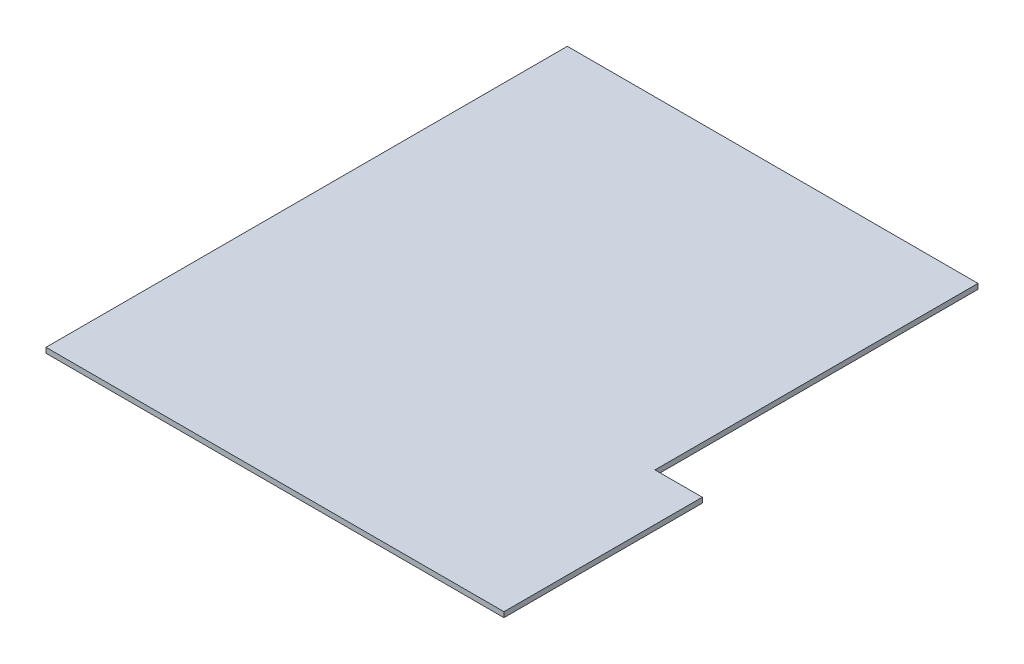
ISO-10303-21;
HEADER;
FILE_DESCRIPTION(('STEP AP214'),'2;1');
FILE_NAME('part.step','',(''),(''),'','','');
FILE_SCHEMA(('AUTOMOTIVE_DESIGN { 1 0 10303 214 1 1 1 1 }'));
ENDSEC;
DATA;
#1=APPLICATION_CONTEXT('core data for automotive mechanical design processes');
#2=APPLICATION_PROTOCOL_DEFINITION('international standard','automotive_design',2000,#1);
#3=PRODUCT_CONTEXT('',#1,'mechanical');
#4=PRODUCT('Part','Part','',(#3));
#5=PRODUCT_RELATED_PRODUCT_CATEGORY('part','',(#4));
#6=PRODUCT_DEFINITION_FORMATION('','',#4);
#7=PRODUCT_DEFINITION_CONTEXT('part definition',#1,'design');
#8=PRODUCT_DEFINITION('design','',#6,#7);
#9=PRODUCT_DEFINITION_SHAPE('','',#8);
#10=(LENGTH_UNIT() NAMED_UNIT(*) SI_UNIT(.MILLI.,.METRE.));
#11=(NAMED_UNIT(*) PLANE_ANGLE_UNIT() SI_UNIT($,.RADIAN.));
#12=(NAMED_UNIT(*) SI_UNIT($,.STERADIAN.) SOLID_ANGLE_UNIT());
#13=UNCERTAINTY_MEASURE_WITH_UNIT(LENGTH_MEASURE(1.E-05),#10,'distance_accuracy_value','');
#14=(GEOMETRIC_REPRESENTATION_CONTEXT(3) GLOBAL_UNCERTAINTY_ASSIGNED_CONTEXT((#13)) GLOBAL_UNIT_ASSIGNED_CONTEXT((#10,
#11,#12)) REPRESENTATION_CONTEXT('',''));
#15=CARTESIAN_POINT('',(0.,0.,0.));
#16=DIRECTION('',(0.,0.,1.));
#17=DIRECTION('',(1.,0.,0.));
#18=AXIS2_PLACEMENT_3D('',#15,#16,#17);
#19=CARTESIAN_POINT('',(0.,110.,0.));
#20=DIRECTION('',(0.,0.,-1.));
#21=DIRECTION('',(-1.,0.,0.));
#22=AXIS2_PLACEMENT_3D('',#19,#20,#21);
#23=PLANE('',#22);
#24=DIRECTION('',(1.,0.,0.));
#25=VECTOR('',#24,1.);
#26=CARTESIAN_POINT('',(0.,0.,0.));
#27=LINE('',#26,#25);
#28=CARTESIAN_POINT('',(0.,0.,0.));
#29=VERTEX_POINT('',#28);
#30=CARTESIAN_POINT('',(9680.,0.,0.));
#31=VERTEX_POINT('',#30);
#32=EDGE_CURVE('E120',#29,#31,#27,.T.);
#33=ORIENTED_EDGE('',*,*,#32,.T.);
#34=DIRECTION('',(0.,-1.,0.));
#35=VECTOR('',#34,1.);
#36=CARTESIAN_POINT('',(9680.,110.,0.));
#37=LINE('',#36,#35);
#38=CARTESIAN_POINT('',(9680.,110.,0.));
#39=VERTEX_POINT('',#38);
#40=EDGE_CURVE('E11',#39,#31,#37,.T.);
#41=ORIENTED_EDGE('',*,*,#40,.F.);
#42=DIRECTION('',(1.,0.,0.));
#43=VECTOR('',#42,1.);
#44=CARTESIAN_POINT('',(0.,110.,0.));
#45=LINE('',#44,#43);
#46=CARTESIAN_POINT('',(0.,110.,0.));
#47=VERTEX_POINT('',#46);
#48=EDGE_CURVE('E130',#47,#39,#45,.T.);
#49=ORIENTED_EDGE('',*,*,#48,.F.);
#50=DIRECTION('',(0.,-1.,0.));
#51=VECTOR('',#50,1.);
#52=CARTESIAN_POINT('',(0.,110.,0.));
#53=LINE('',#52,#51);
#54=EDGE_CURVE('E116',#47,#29,#53,.T.);
#55=ORIENTED_EDGE('',*,*,#54,.T.);
#56=EDGE_LOOP('',(#33,#41,#49,#55));
#57=FACE_BOUND('',#56,.T.);
#58=ADVANCED_FACE('F36',(#57),#23,.F.);
#59=CARTESIAN_POINT('',(9680.,110.,0.));
#60=DIRECTION('',(-1.,0.,0.));
#61=DIRECTION('',(0.,0.,1.));
#62=AXIS2_PLACEMENT_3D('',#59,#60,#61);
#63=PLANE('',#62);
#64=DIRECTION('',(0.,0.,-1.));
#65=VECTOR('',#64,1.);
#66=CARTESIAN_POINT('',(9680.,0.,0.));
#67=LINE('',#66,#65);
#68=CARTESIAN_POINT('',(9680.,0.,-4191.8));
#69=VERTEX_POINT('',#68);
#70=EDGE_CURVE('E123',#31,#69,#67,.T.);
#71=ORIENTED_EDGE('',*,*,#70,.T.);
#72=DIRECTION('',(0.,-1.,0.));
#73=VECTOR('',#72,1.);
#74=CARTESIAN_POINT('',(9680.,110.,-4191.8));
#75=LINE('',#74,#73);
#76=CARTESIAN_POINT('',(9680.,110.,-4191.8));
#77=VERTEX_POINT('',#76);
#78=EDGE_CURVE('E44',#77,#69,#75,.T.);
#79=ORIENTED_EDGE('',*,*,#78,.F.);
#80=DIRECTION('',(0.,0.,-1.));
#81=VECTOR('',#80,1.);
#82=CARTESIAN_POINT('',(9680.,110.,0.));
#83=LINE('',#82,#81);
#84=EDGE_CURVE('E89',#39,#77,#83,.T.);
#85=ORIENTED_EDGE('',*,*,#84,.F.);
#86=ORIENTED_EDGE('',*,*,#40,.T.);
#87=EDGE_LOOP('',(#71,#79,#85,#86));
#88=FACE_BOUND('',#87,.T.);
#89=ADVANCED_FACE('F154',(#88),#63,.F.);
#90=CARTESIAN_POINT('',(8680.,110.,-4191.8));
#91=DIRECTION('',(0.,0.,1.));
#92=DIRECTION('',(1.,0.,0.));
#93=AXIS2_PLACEMENT_3D('',#90,#91,#92);
#94=PLANE('',#93);
#95=DIRECTION('',(-1.,0.,0.));
#96=VECTOR('',#95,1.);
#97=CARTESIAN_POINT('',(8680.,0.,-4191.8));
#98=LINE('',#97,#96);
#99=CARTESIAN_POINT('',(8680.,0.,-4191.8));
#100=VERTEX_POINT('',#99);
#101=EDGE_CURVE('E125',#69,#100,#98,.T.);
#102=ORIENTED_EDGE('',*,*,#101,.T.);
#103=DIRECTION('',(0.,-1.,0.));
#104=VECTOR('',#103,1.);
#105=CARTESIAN_POINT('',(8680.,110.,-4191.8));
#106=LINE('',#105,#104);
#107=CARTESIAN_POINT('',(8680.,110.,-4191.8));
#108=VERTEX_POINT('',#107);
#109=EDGE_CURVE('E111',#108,#100,#106,.T.);
#110=ORIENTED_EDGE('',*,*,#109,.F.);
#111=DIRECTION('',(-1.,0.,0.));
#112=VECTOR('',#111,1.);
#113=CARTESIAN_POINT('',(8680.,110.,-4191.8));
#114=LINE('',#113,#112);
#115=EDGE_CURVE('E102',#77,#108,#114,.T.);
#116=ORIENTED_EDGE('',*,*,#115,.F.);
#117=ORIENTED_EDGE('',*,*,#78,.T.);
#118=EDGE_LOOP('',(#102,#110,#116,#117));
#119=FACE_BOUND('',#118,.T.);
#120=ADVANCED_FACE('F136',(#119),#94,.F.);
#121=CARTESIAN_POINT('',(8680.,110.,-11020.));
#122=DIRECTION('',(-1.,0.,0.));
#123=DIRECTION('',(0.,0.,1.));
#124=AXIS2_PLACEMENT_3D('',#121,#122,#123);
#125=PLANE('',#124);
#126=DIRECTION('',(0.,0.,-1.));
#127=VECTOR('',#126,1.);
#128=CARTESIAN_POINT('',(8680.,0.,-11020.));
#129=LINE('',#128,#127);
#130=CARTESIAN_POINT('',(8680.,0.,-11020.));
#131=VERTEX_POINT('',#130);
#132=EDGE_CURVE('E110',#100,#131,#129,.T.);
#133=ORIENTED_EDGE('',*,*,#132,.T.);
#134=DIRECTION('',(0.,-1.,0.));
#135=VECTOR('',#134,1.);
#136=CARTESIAN_POINT('',(8680.,110.,-11020.));
#137=LINE('',#136,#135);
#138=CARTESIAN_POINT('',(8680.,110.,-11020.));
#139=VERTEX_POINT('',#138);
#140=EDGE_CURVE('E107',#139,#131,#137,.T.);
#141=ORIENTED_EDGE('',*,*,#140,.F.);
#142=DIRECTION('',(0.,0.,-1.));
#143=VECTOR('',#142,1.);
#144=CARTESIAN_POINT('',(8680.,110.,-11020.));
#145=LINE('',#144,#143);
#146=EDGE_CURVE('E96',#108,#139,#145,.T.);
#147=ORIENTED_EDGE('',*,*,#146,.F.);
#148=ORIENTED_EDGE('',*,*,#109,.T.);
#149=EDGE_LOOP('',(#133,#141,#147,#148));
#150=FACE_BOUND('',#149,.T.);
#151=ADVANCED_FACE('F108',(#150),#125,.F.);
#152=CARTESIAN_POINT('',(8680.,110.,-11020.));
#153=DIRECTION('',(0.,0.,1.));
#154=DIRECTION('',(1.,0.,0.));
#155=AXIS2_PLACEMENT_3D('',#152,#153,#154);
#156=PLANE('',#155);
#157=DIRECTION('',(-1.,0.,0.));
#158=VECTOR('',#157,1.);
#159=CARTESIAN_POINT('',(8680.,0.,-11020.));
#160=LINE('',#159,#158);
#161=CARTESIAN_POINT('',(0.,0.,-11020.));
#162=VERTEX_POINT('',#161);
#163=EDGE_CURVE('E75',#131,#162,#160,.T.);
#164=ORIENTED_EDGE('',*,*,#163,.T.);
#165=DIRECTION('',(0.,-1.,0.));
#166=VECTOR('',#165,1.);
#167=CARTESIAN_POINT('',(0.,110.,-11020.));
#168=LINE('',#167,#166);
#169=CARTESIAN_POINT('',(0.,110.,-11020.));
#170=VERTEX_POINT('',#169);
#171=EDGE_CURVE('E112',#170,#162,#168,.T.);
#172=ORIENTED_EDGE('',*,*,#171,.F.);
#173=DIRECTION('',(-1.,0.,0.));
#174=VECTOR('',#173,1.);
#175=CARTESIAN_POINT('',(8680.,110.,-11020.));
#176=LINE('',#175,#174);
#177=EDGE_CURVE('E100',#139,#170,#176,.T.);
#178=ORIENTED_EDGE('',*,*,#177,.F.);
#179=ORIENTED_EDGE('',*,*,#140,.T.);
#180=EDGE_LOOP('',(#164,#172,#178,#179));
#181=FACE_BOUND('',#180,.T.);
#182=ADVANCED_FACE('F114',(#181),#156,.F.);
#183=CARTESIAN_POINT('',(0.,110.,-11020.));
#184=DIRECTION('',(1.,0.,0.));
#185=DIRECTION('',(0.,0.,-1.));
#186=AXIS2_PLACEMENT_3D('',#183,#184,#185);
#187=PLANE('',#186);
#188=DIRECTION('',(0.,0.,1.));
#189=VECTOR('',#188,1.);
#190=CARTESIAN_POINT('',(0.,0.,-11020.));
#191=LINE('',#190,#189);
#192=EDGE_CURVE('E81',#162,#29,#191,.T.);
#193=ORIENTED_EDGE('',*,*,#192,.T.);
#194=ORIENTED_EDGE('',*,*,#54,.F.);
#195=DIRECTION('',(0.,0.,1.));
#196=VECTOR('',#195,1.);
#197=CARTESIAN_POINT('',(0.,110.,-11020.));
#198=LINE('',#197,#196);
#199=EDGE_CURVE('E52',#170,#47,#198,.T.);
#200=ORIENTED_EDGE('',*,*,#199,.F.);
#201=ORIENTED_EDGE('',*,*,#171,.T.);
#202=EDGE_LOOP('',(#193,#194,#200,#201));
#203=FACE_BOUND('',#202,.T.);
#204=ADVANCED_FACE('F143',(#203),#187,.F.);
#205=CARTESIAN_POINT('',(0.,110.,0.));
#206=DIRECTION('',(0.,1.,0.));
#207=DIRECTION('',(0.,0.,1.));
#208=AXIS2_PLACEMENT_3D('',#205,#206,#207);
#209=PLANE('',#208);
#210=ORIENTED_EDGE('',*,*,#48,.T.);
#211=ORIENTED_EDGE('',*,*,#84,.T.);
#212=ORIENTED_EDGE('',*,*,#115,.T.);
#213=ORIENTED_EDGE('',*,*,#146,.T.);
#214=ORIENTED_EDGE('',*,*,#177,.T.);
#215=ORIENTED_EDGE('',*,*,#199,.T.);
#216=EDGE_LOOP('',(#210,#211,#212,#213,#214,#215));
#217=FACE_BOUND('',#216,.T.);
#218=ADVANCED_FACE('F98',(#217),#209,.T.);
#219=CARTESIAN_POINT('',(0.,0.,0.));
#220=DIRECTION('',(0.,1.,0.));
#221=DIRECTION('',(0.,0.,1.));
#222=AXIS2_PLACEMENT_3D('',#219,#220,#221);
#223=PLANE('',#222);
#224=ORIENTED_EDGE('',*,*,#32,.F.);
#225=ORIENTED_EDGE('',*,*,#192,.F.);
#226=ORIENTED_EDGE('',*,*,#163,.F.);
#227=ORIENTED_EDGE('',*,*,#132,.F.);
#228=ORIENTED_EDGE('',*,*,#101,.F.);
#229=ORIENTED_EDGE('',*,*,#70,.F.);
#230=EDGE_LOOP('',(#224,#225,#226,#227,#228,#229));
#231=FACE_BOUND('',#230,.T.);
#232=ADVANCED_FACE('F139',(#231),#223,.F.);
#233=CLOSED_SHELL('',(#58,#89,#120,#151,#182,#204,#218,#232));
#234=MANIFOLD_SOLID_BREP('B2',#233);
#235=ADVANCED_BREP_SHAPE_REPRESENTATION('',(#18,#234),#14);
#236=SHAPE_DEFINITION_REPRESENTATION(#9,#235);
ENDSEC;
END-ISO-10303-21;
